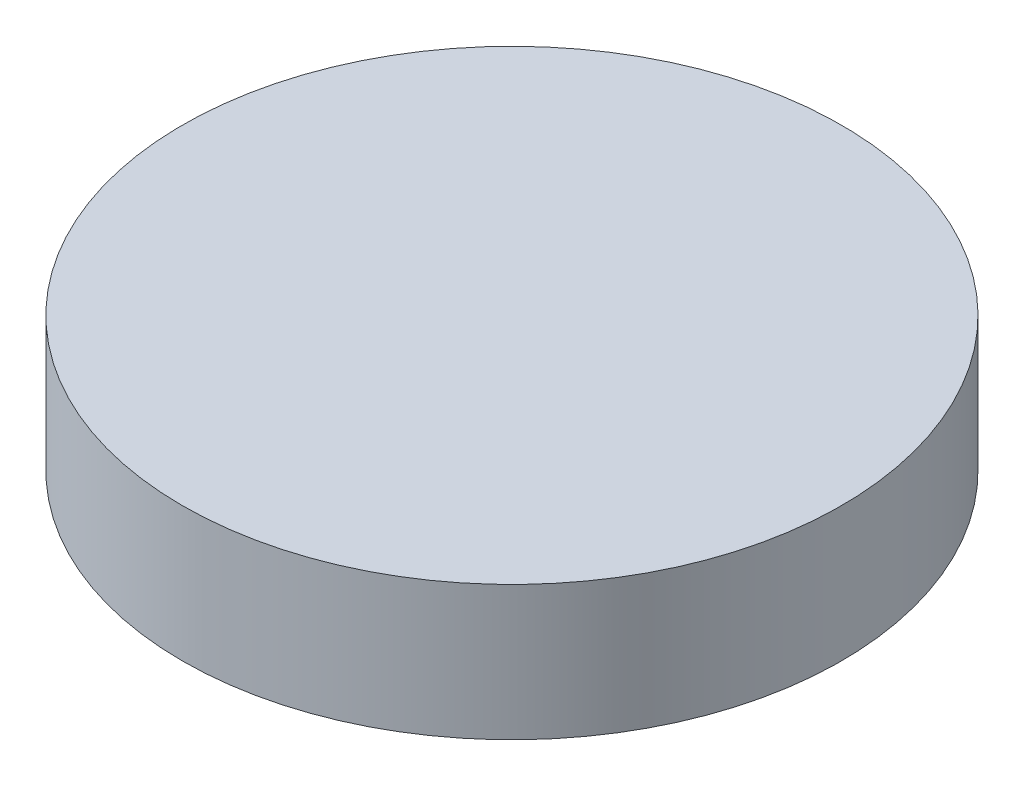
ISO-10303-21;
HEADER;
FILE_DESCRIPTION(('STEP AP214'),'2;1');
FILE_NAME('part.step','',(''),(''),'','','');
FILE_SCHEMA(('AUTOMOTIVE_DESIGN { 1 0 10303 214 1 1 1 1 }'));
ENDSEC;
DATA;
#1=APPLICATION_CONTEXT('core data for automotive mechanical design processes');
#2=APPLICATION_PROTOCOL_DEFINITION('international standard','automotive_design',2000,#1);
#3=PRODUCT_CONTEXT('',#1,'mechanical');
#4=PRODUCT('Part','Part','',(#3));
#5=PRODUCT_RELATED_PRODUCT_CATEGORY('part','',(#4));
#6=PRODUCT_DEFINITION_FORMATION('','',#4);
#7=PRODUCT_DEFINITION_CONTEXT('part definition',#1,'design');
#8=PRODUCT_DEFINITION('design','',#6,#7);
#9=PRODUCT_DEFINITION_SHAPE('','',#8);
#10=(LENGTH_UNIT() NAMED_UNIT(*) SI_UNIT(.MILLI.,.METRE.));
#11=(NAMED_UNIT(*) PLANE_ANGLE_UNIT() SI_UNIT($,.RADIAN.));
#12=(NAMED_UNIT(*) SI_UNIT($,.STERADIAN.) SOLID_ANGLE_UNIT());
#13=UNCERTAINTY_MEASURE_WITH_UNIT(LENGTH_MEASURE(1.E-05),#10,'distance_accuracy_value','');
#14=(GEOMETRIC_REPRESENTATION_CONTEXT(3) GLOBAL_UNCERTAINTY_ASSIGNED_CONTEXT((#13)) GLOBAL_UNIT_ASSIGNED_CONTEXT((#10,
#11,#12)) REPRESENTATION_CONTEXT('',''));
#15=CARTESIAN_POINT('',(0.,0.,0.));
#16=DIRECTION('',(0.,0.,1.));
#17=DIRECTION('',(1.,0.,0.));
#18=AXIS2_PLACEMENT_3D('',#15,#16,#17);
#19=CARTESIAN_POINT('',(-10.5923354528859,5.,2.18044882235162));
#20=DIRECTION('',(0.,-1.,0.));
#21=DIRECTION('',(0.,0.,-1.));
#22=AXIS2_PLACEMENT_3D('',#19,#20,#21);
#23=CYLINDRICAL_SURFACE('',#22,12.25);
#24=CARTESIAN_POINT('',(-10.5923354528859,5.,2.18044882235162));
#25=DIRECTION('',(0.,1.,0.));
#26=DIRECTION('',(0.,0.,1.));
#27=AXIS2_PLACEMENT_3D('',#24,#25,#26);
#28=CIRCLE('',#27,12.25);
#29=CARTESIAN_POINT('',(-10.5923354528859,5.,14.4304488223516));
#30=VERTEX_POINT('',#29);
#31=EDGE_CURVE('E10',#30,#30,#28,.T.);
#32=ORIENTED_EDGE('',*,*,#31,.F.);
#33=EDGE_LOOP('',(#32));
#34=FACE_BOUND('',#33,.T.);
#35=CARTESIAN_POINT('',(-10.5923354528859,0.,2.18044882235162));
#36=DIRECTION('',(0.,1.,0.));
#37=DIRECTION('',(0.,0.,1.));
#38=AXIS2_PLACEMENT_3D('',#35,#36,#37);
#39=CIRCLE('',#38,12.25);
#40=CARTESIAN_POINT('',(-10.5923354528859,0.,14.4304488223516));
#41=VERTEX_POINT('',#40);
#42=EDGE_CURVE('E34',#41,#41,#39,.T.);
#43=ORIENTED_EDGE('',*,*,#42,.T.);
#44=EDGE_LOOP('',(#43));
#45=FACE_BOUND('',#44,.T.);
#46=ADVANCED_FACE('F31',(#34,#45),#23,.T.);
#47=CARTESIAN_POINT('',(-10.5923354528859,5.,2.18044882235162));
#48=DIRECTION('',(0.,1.,0.));
#49=DIRECTION('',(0.,0.,1.));
#50=AXIS2_PLACEMENT_3D('',#47,#48,#49);
#51=PLANE('',#50);
#52=ORIENTED_EDGE('',*,*,#31,.T.);
#53=EDGE_LOOP('',(#52));
#54=FACE_BOUND('',#53,.T.);
#55=ADVANCED_FACE('F46',(#54),#51,.T.);
#56=CARTESIAN_POINT('',(-10.5923354528859,0.,2.18044882235162));
#57=DIRECTION('',(0.,1.,0.));
#58=DIRECTION('',(0.,0.,1.));
#59=AXIS2_PLACEMENT_3D('',#56,#57,#58);
#60=PLANE('',#59);
#61=ORIENTED_EDGE('',*,*,#42,.F.);
#62=EDGE_LOOP('',(#61));
#63=FACE_BOUND('',#62,.T.);
#64=ADVANCED_FACE('F44',(#63),#60,.F.);
#65=CLOSED_SHELL('',(#46,#55,#64));
#66=MANIFOLD_SOLID_BREP('B2',#65);
#67=ADVANCED_BREP_SHAPE_REPRESENTATION('',(#18,#66),#14);
#68=SHAPE_DEFINITION_REPRESENTATION(#9,#67);
ENDSEC;
END-ISO-10303-21;
